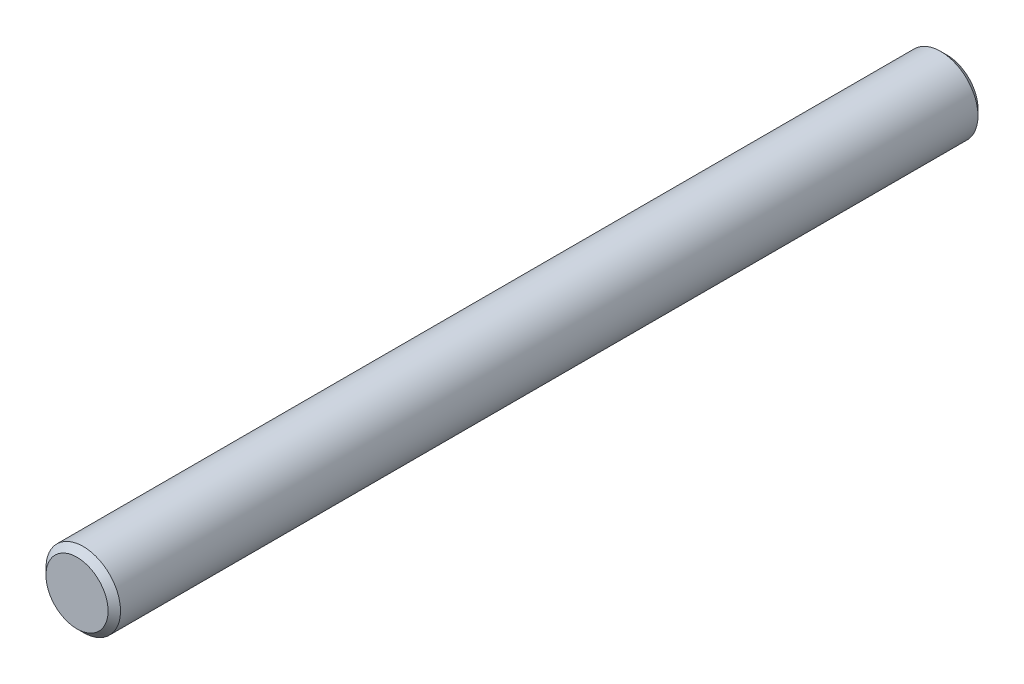
ISO-10303-21;
HEADER;
FILE_DESCRIPTION(('STEP AP214'),'2;1');
FILE_NAME('part.step','',(''),(''),'','','');
FILE_SCHEMA(('AUTOMOTIVE_DESIGN { 1 0 10303 214 1 1 1 1 }'));
ENDSEC;
DATA;
#1=APPLICATION_CONTEXT('core data for automotive mechanical design processes');
#2=APPLICATION_PROTOCOL_DEFINITION('international standard','automotive_design',2000,#1);
#3=PRODUCT_CONTEXT('',#1,'mechanical');
#4=PRODUCT('Part','Part','',(#3));
#5=PRODUCT_RELATED_PRODUCT_CATEGORY('part','',(#4));
#6=PRODUCT_DEFINITION_FORMATION('','',#4);
#7=PRODUCT_DEFINITION_CONTEXT('part definition',#1,'design');
#8=PRODUCT_DEFINITION('design','',#6,#7);
#9=PRODUCT_DEFINITION_SHAPE('','',#8);
#10=(LENGTH_UNIT() NAMED_UNIT(*) SI_UNIT(.MILLI.,.METRE.));
#11=(NAMED_UNIT(*) PLANE_ANGLE_UNIT() SI_UNIT($,.RADIAN.));
#12=(NAMED_UNIT(*) SI_UNIT($,.STERADIAN.) SOLID_ANGLE_UNIT());
#13=UNCERTAINTY_MEASURE_WITH_UNIT(LENGTH_MEASURE(1.E-05),#10,'distance_accuracy_value','');
#14=(GEOMETRIC_REPRESENTATION_CONTEXT(3) GLOBAL_UNCERTAINTY_ASSIGNED_CONTEXT((#13)) GLOBAL_UNIT_ASSIGNED_CONTEXT((#10,
#11,#12)) REPRESENTATION_CONTEXT('',''));
#15=CARTESIAN_POINT('',(0.,0.,0.));
#16=DIRECTION('',(0.,0.,1.));
#17=DIRECTION('',(1.,0.,0.));
#18=AXIS2_PLACEMENT_3D('',#15,#16,#17);
#19=CARTESIAN_POINT('',(0.,0.,70.));
#20=DIRECTION('',(0.,0.,-1.));
#21=DIRECTION('',(-1.,0.,0.));
#22=AXIS2_PLACEMENT_3D('',#19,#20,#21);
#23=CYLINDRICAL_SURFACE('',#22,3.);
#24=CARTESIAN_POINT('',(0.,0.,0.500000000000014));
#25=DIRECTION('',(0.,0.,1.));
#26=DIRECTION('',(1.,0.,0.));
#27=AXIS2_PLACEMENT_3D('',#24,#25,#26);
#28=CIRCLE('',#27,3.);
#29=CARTESIAN_POINT('',(3.,0.,0.500000000000014));
#30=VERTEX_POINT('',#29);
#31=EDGE_CURVE('E41',#30,#30,#28,.T.);
#32=ORIENTED_EDGE('',*,*,#31,.T.);
#33=EDGE_LOOP('',(#32));
#34=FACE_BOUND('',#33,.T.);
#35=CARTESIAN_POINT('',(0.,0.,69.5));
#36=DIRECTION('',(0.,0.,1.));
#37=DIRECTION('',(1.,0.,0.));
#38=AXIS2_PLACEMENT_3D('',#35,#36,#37);
#39=CIRCLE('',#38,3.);
#40=CARTESIAN_POINT('',(3.,0.,69.5));
#41=VERTEX_POINT('',#40);
#42=EDGE_CURVE('E45',#41,#41,#39,.F.);
#43=ORIENTED_EDGE('',*,*,#42,.T.);
#44=EDGE_LOOP('',(#43));
#45=FACE_BOUND('',#44,.T.);
#46=ADVANCED_FACE('F30',(#34,#45),#23,.T.);
#47=CARTESIAN_POINT('',(0.,0.,70.));
#48=DIRECTION('',(0.,0.,1.));
#49=DIRECTION('',(1.,0.,0.));
#50=AXIS2_PLACEMENT_3D('',#47,#48,#49);
#51=PLANE('',#50);
#52=CARTESIAN_POINT('',(0.,0.,70.));
#53=DIRECTION('',(0.,0.,1.));
#54=DIRECTION('',(1.,0.,0.));
#55=AXIS2_PLACEMENT_3D('',#52,#53,#54);
#56=CIRCLE('',#55,2.50000000000001);
#57=CARTESIAN_POINT('',(2.50000000000001,0.,70.));
#58=VERTEX_POINT('',#57);
#59=EDGE_CURVE('E10',#58,#58,#56,.T.);
#60=ORIENTED_EDGE('',*,*,#59,.T.);
#61=EDGE_LOOP('',(#60));
#62=FACE_BOUND('',#61,.T.);
#63=ADVANCED_FACE('F61',(#62),#51,.T.);
#64=CARTESIAN_POINT('',(0.,0.,0.));
#65=DIRECTION('',(0.,0.,1.));
#66=DIRECTION('',(1.,0.,0.));
#67=AXIS2_PLACEMENT_3D('',#64,#65,#66);
#68=PLANE('',#67);
#69=CARTESIAN_POINT('',(0.,0.,0.));
#70=DIRECTION('',(0.,0.,1.));
#71=DIRECTION('',(1.,0.,0.));
#72=AXIS2_PLACEMENT_3D('',#69,#70,#71);
#73=CIRCLE('',#72,2.5);
#74=CARTESIAN_POINT('',(2.5,0.,0.));
#75=VERTEX_POINT('',#74);
#76=EDGE_CURVE('E37',#75,#75,#73,.F.);
#77=ORIENTED_EDGE('',*,*,#76,.T.);
#78=EDGE_LOOP('',(#77));
#79=FACE_BOUND('',#78,.T.);
#80=ADVANCED_FACE('F58',(#79),#68,.F.);
#81=CARTESIAN_POINT('',(0.,0.,0.500000000000014));
#82=DIRECTION('',(0.,0.,1.));
#83=DIRECTION('',(1.,0.,0.));
#84=AXIS2_PLACEMENT_3D('',#81,#82,#83);
#85=CONICAL_SURFACE('',#84,3.,0.785398163397439);
#86=ORIENTED_EDGE('',*,*,#76,.F.);
#87=EDGE_LOOP('',(#86));
#88=FACE_BOUND('',#87,.T.);
#89=ORIENTED_EDGE('',*,*,#31,.F.);
#90=EDGE_LOOP('',(#89));
#91=FACE_BOUND('',#90,.T.);
#92=ADVANCED_FACE('F54',(#88,#91),#85,.T.);
#93=CARTESIAN_POINT('',(0.,0.,70.));
#94=DIRECTION('',(0.,0.,-1.));
#95=DIRECTION('',(-1.,0.,0.));
#96=AXIS2_PLACEMENT_3D('',#93,#94,#95);
#97=CONICAL_SURFACE('',#96,2.50000000000001,0.785398163397439);
#98=ORIENTED_EDGE('',*,*,#42,.F.);
#99=EDGE_LOOP('',(#98));
#100=FACE_BOUND('',#99,.T.);
#101=ORIENTED_EDGE('',*,*,#59,.F.);
#102=EDGE_LOOP('',(#101));
#103=FACE_BOUND('',#102,.T.);
#104=ADVANCED_FACE('F32',(#100,#103),#97,.T.);
#105=CLOSED_SHELL('',(#46,#63,#80,#92,#104));
#106=MANIFOLD_SOLID_BREP('B2',#105);
#107=ADVANCED_BREP_SHAPE_REPRESENTATION('',(#18,#106),#14);
#108=SHAPE_DEFINITION_REPRESENTATION(#9,#107);
ENDSEC;
END-ISO-10303-21;
